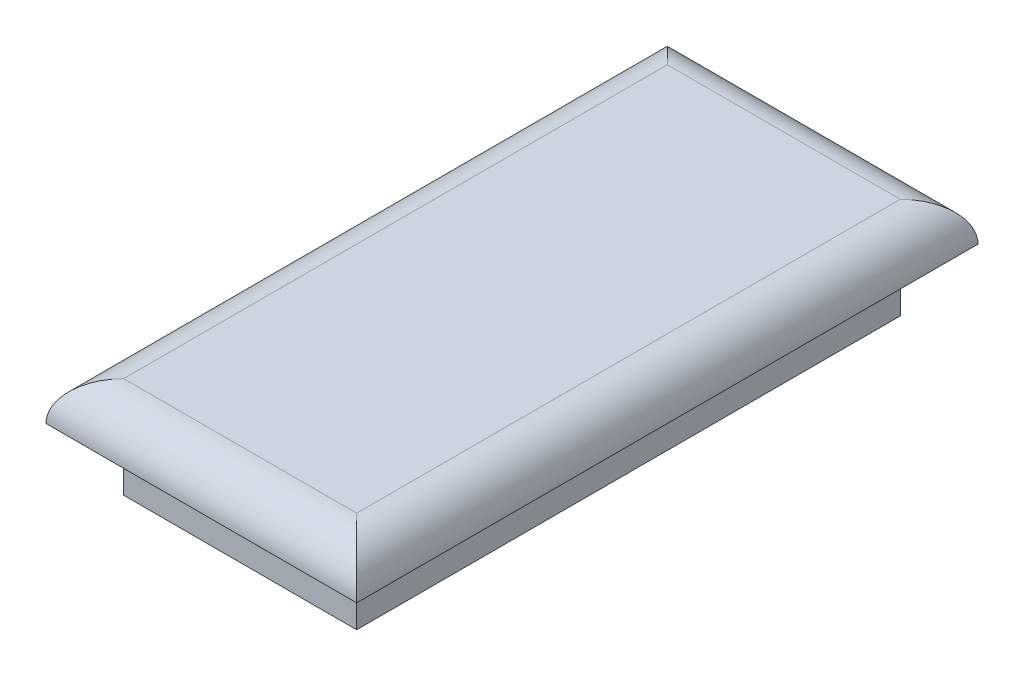
ISO-10303-21;
HEADER;
FILE_DESCRIPTION(('STEP AP214'),'2;1');
FILE_NAME('part.step','',(''),(''),'','','');
FILE_SCHEMA(('AUTOMOTIVE_DESIGN { 1 0 10303 214 1 1 1 1 }'));
ENDSEC;
DATA;
#1=APPLICATION_CONTEXT('core data for automotive mechanical design processes');
#2=APPLICATION_PROTOCOL_DEFINITION('international standard','automotive_design',2000,#1);
#3=PRODUCT_CONTEXT('',#1,'mechanical');
#4=PRODUCT('Part','Part','',(#3));
#5=PRODUCT_RELATED_PRODUCT_CATEGORY('part','',(#4));
#6=PRODUCT_DEFINITION_FORMATION('','',#4);
#7=PRODUCT_DEFINITION_CONTEXT('part definition',#1,'design');
#8=PRODUCT_DEFINITION('design','',#6,#7);
#9=PRODUCT_DEFINITION_SHAPE('','',#8);
#10=(LENGTH_UNIT() NAMED_UNIT(*) SI_UNIT(.MILLI.,.METRE.));
#11=(NAMED_UNIT(*) PLANE_ANGLE_UNIT() SI_UNIT($,.RADIAN.));
#12=(NAMED_UNIT(*) SI_UNIT($,.STERADIAN.) SOLID_ANGLE_UNIT());
#13=UNCERTAINTY_MEASURE_WITH_UNIT(LENGTH_MEASURE(1.E-05),#10,'distance_accuracy_value','');
#14=(GEOMETRIC_REPRESENTATION_CONTEXT(3) GLOBAL_UNCERTAINTY_ASSIGNED_CONTEXT((#13)) GLOBAL_UNIT_ASSIGNED_CONTEXT((#10,
#11,#12)) REPRESENTATION_CONTEXT('',''));
#15=CARTESIAN_POINT('',(0.,0.,0.));
#16=DIRECTION('',(0.,0.,1.));
#17=DIRECTION('',(1.,0.,0.));
#18=AXIS2_PLACEMENT_3D('',#15,#16,#17);
#19=CARTESIAN_POINT('',(9.525,5.08,22.225));
#20=DIRECTION('',(-1.,0.,0.));
#21=DIRECTION('',(0.,0.,1.));
#22=AXIS2_PLACEMENT_3D('',#19,#20,#21);
#23=PLANE('',#22);
#24=DIRECTION('',(0.,0.,-1.));
#25=VECTOR('',#24,1.);
#26=CARTESIAN_POINT('',(9.525,0.,22.225));
#27=LINE('',#26,#25);
#28=CARTESIAN_POINT('',(9.525,0.,22.225));
#29=VERTEX_POINT('',#28);
#30=CARTESIAN_POINT('',(9.525,0.,-22.225));
#31=VERTEX_POINT('',#30);
#32=EDGE_CURVE('E126',#29,#31,#27,.T.);
#33=ORIENTED_EDGE('',*,*,#32,.T.);
#34=DIRECTION('',(0.,-1.,0.));
#35=VECTOR('',#34,1.);
#36=CARTESIAN_POINT('',(9.525,5.08,-22.225));
#37=LINE('',#36,#35);
#38=CARTESIAN_POINT('',(9.525,5.08,-22.225));
#39=VERTEX_POINT('',#38);
#40=EDGE_CURVE('E156',#39,#31,#37,.T.);
#41=ORIENTED_EDGE('',*,*,#40,.F.);
#42=DIRECTION('',(0.,0.,-1.));
#43=VECTOR('',#42,1.);
#44=CARTESIAN_POINT('',(9.525,5.08,22.225));
#45=LINE('',#44,#43);
#46=CARTESIAN_POINT('',(9.525,5.08,22.225));
#47=VERTEX_POINT('',#46);
#48=EDGE_CURVE('E127',#47,#39,#45,.T.);
#49=ORIENTED_EDGE('',*,*,#48,.F.);
#50=DIRECTION('',(0.,-1.,0.));
#51=VECTOR('',#50,1.);
#52=CARTESIAN_POINT('',(9.525,5.08,22.225));
#53=LINE('',#52,#51);
#54=EDGE_CURVE('E140',#47,#29,#53,.T.);
#55=ORIENTED_EDGE('',*,*,#54,.T.);
#56=EDGE_LOOP('',(#33,#41,#49,#55));
#57=FACE_BOUND('',#56,.T.);
#58=ADVANCED_FACE('F37',(#57),#23,.F.);
#59=CARTESIAN_POINT('',(-9.525,5.08,-22.225));
#60=DIRECTION('',(0.,0.,1.));
#61=DIRECTION('',(1.,0.,0.));
#62=AXIS2_PLACEMENT_3D('',#59,#60,#61);
#63=PLANE('',#62);
#64=DIRECTION('',(-1.,0.,0.));
#65=VECTOR('',#64,1.);
#66=CARTESIAN_POINT('',(-9.525,0.,-22.225));
#67=LINE('',#66,#65);
#68=CARTESIAN_POINT('',(-9.525,0.,-22.225));
#69=VERTEX_POINT('',#68);
#70=EDGE_CURVE('E143',#31,#69,#67,.T.);
#71=ORIENTED_EDGE('',*,*,#70,.T.);
#72=DIRECTION('',(0.,-1.,0.));
#73=VECTOR('',#72,1.);
#74=CARTESIAN_POINT('',(-9.525,5.08,-22.225));
#75=LINE('',#74,#73);
#76=CARTESIAN_POINT('',(-9.525,5.08,-22.225));
#77=VERTEX_POINT('',#76);
#78=EDGE_CURVE('E153',#77,#69,#75,.T.);
#79=ORIENTED_EDGE('',*,*,#78,.F.);
#80=DIRECTION('',(-1.,0.,0.));
#81=VECTOR('',#80,1.);
#82=CARTESIAN_POINT('',(-9.525,5.08,-22.225));
#83=LINE('',#82,#81);
#84=EDGE_CURVE('E130',#39,#77,#83,.T.);
#85=ORIENTED_EDGE('',*,*,#84,.F.);
#86=ORIENTED_EDGE('',*,*,#40,.T.);
#87=EDGE_LOOP('',(#71,#79,#85,#86));
#88=FACE_BOUND('',#87,.T.);
#89=ADVANCED_FACE('F183',(#88),#63,.F.);
#90=CARTESIAN_POINT('',(-9.525,5.08,22.225));
#91=DIRECTION('',(1.,0.,0.));
#92=DIRECTION('',(0.,0.,-1.));
#93=AXIS2_PLACEMENT_3D('',#90,#91,#92);
#94=PLANE('',#93);
#95=DIRECTION('',(0.,0.,1.));
#96=VECTOR('',#95,1.);
#97=CARTESIAN_POINT('',(-9.525,0.,22.225));
#98=LINE('',#97,#96);
#99=CARTESIAN_POINT('',(-9.525,0.,22.225));
#100=VERTEX_POINT('',#99);
#101=EDGE_CURVE('E145',#69,#100,#98,.T.);
#102=ORIENTED_EDGE('',*,*,#101,.T.);
#103=DIRECTION('',(0.,-1.,0.));
#104=VECTOR('',#103,1.);
#105=CARTESIAN_POINT('',(-9.525,5.08,22.225));
#106=LINE('',#105,#104);
#107=CARTESIAN_POINT('',(-9.525,5.08,22.225));
#108=VERTEX_POINT('',#107);
#109=EDGE_CURVE('E150',#108,#100,#106,.T.);
#110=ORIENTED_EDGE('',*,*,#109,.F.);
#111=DIRECTION('',(0.,0.,1.));
#112=VECTOR('',#111,1.);
#113=CARTESIAN_POINT('',(-9.525,5.08,22.225));
#114=LINE('',#113,#112);
#115=EDGE_CURVE('E134',#77,#108,#114,.T.);
#116=ORIENTED_EDGE('',*,*,#115,.F.);
#117=ORIENTED_EDGE('',*,*,#78,.T.);
#118=EDGE_LOOP('',(#102,#110,#116,#117));
#119=FACE_BOUND('',#118,.T.);
#120=ADVANCED_FACE('F189',(#119),#94,.F.);
#121=CARTESIAN_POINT('',(-9.525,5.08,22.225));
#122=DIRECTION('',(0.,0.,-1.));
#123=DIRECTION('',(-1.,0.,0.));
#124=AXIS2_PLACEMENT_3D('',#121,#122,#123);
#125=PLANE('',#124);
#126=DIRECTION('',(1.,0.,0.));
#127=VECTOR('',#126,1.);
#128=CARTESIAN_POINT('',(-9.525,0.,22.225));
#129=LINE('',#128,#127);
#130=EDGE_CURVE('E131',#100,#29,#129,.T.);
#131=ORIENTED_EDGE('',*,*,#130,.T.);
#132=ORIENTED_EDGE('',*,*,#54,.F.);
#133=DIRECTION('',(1.,0.,0.));
#134=VECTOR('',#133,1.);
#135=CARTESIAN_POINT('',(-9.525,5.08,22.225));
#136=LINE('',#135,#134);
#137=EDGE_CURVE('E137',#108,#47,#136,.T.);
#138=ORIENTED_EDGE('',*,*,#137,.F.);
#139=ORIENTED_EDGE('',*,*,#109,.T.);
#140=EDGE_LOOP('',(#131,#132,#138,#139));
#141=FACE_BOUND('',#140,.T.);
#142=ADVANCED_FACE('F179',(#141),#125,.F.);
#143=CARTESIAN_POINT('',(0.,0.,0.));
#144=DIRECTION('',(0.,-1.,0.));
#145=DIRECTION('',(0.,0.,-1.));
#146=AXIS2_PLACEMENT_3D('',#143,#144,#145);
#147=PLANE('',#146);
#148=ORIENTED_EDGE('',*,*,#32,.F.);
#149=ORIENTED_EDGE('',*,*,#130,.F.);
#150=ORIENTED_EDGE('',*,*,#101,.F.);
#151=ORIENTED_EDGE('',*,*,#70,.F.);
#152=EDGE_LOOP('',(#148,#149,#150,#151));
#153=FACE_BOUND('',#152,.T.);
#154=ADVANCED_FACE('F171',(#153),#147,.T.);
#155=CARTESIAN_POINT('',(0.,8.255,0.));
#156=DIRECTION('',(0.,-1.,0.));
#157=DIRECTION('',(0.,0.,-1.));
#158=AXIS2_PLACEMENT_3D('',#155,#156,#157);
#159=PLANE('',#158);
#160=DIRECTION('',(0.,0.,-1.));
#161=VECTOR('',#160,1.);
#162=CARTESIAN_POINT('',(9.525,8.255,0.));
#163=LINE('',#162,#161);
#164=CARTESIAN_POINT('',(9.525,8.255,22.225));
#165=VERTEX_POINT('',#164);
#166=CARTESIAN_POINT('',(9.525,8.255,-22.225));
#167=VERTEX_POINT('',#166);
#168=EDGE_CURVE('E159',#165,#167,#163,.T.);
#169=ORIENTED_EDGE('',*,*,#168,.T.);
#170=DIRECTION('',(-1.,0.,0.));
#171=VECTOR('',#170,1.);
#172=CARTESIAN_POINT('',(0.,8.255,-22.225));
#173=LINE('',#172,#171);
#174=CARTESIAN_POINT('',(-9.525,8.255,-22.225));
#175=VERTEX_POINT('',#174);
#176=EDGE_CURVE('E11',#167,#175,#173,.T.);
#177=ORIENTED_EDGE('',*,*,#176,.T.);
#178=DIRECTION('',(0.,0.,1.));
#179=VECTOR('',#178,1.);
#180=CARTESIAN_POINT('',(-9.525,8.255,0.));
#181=LINE('',#180,#179);
#182=CARTESIAN_POINT('',(-9.525,8.255,22.225));
#183=VERTEX_POINT('',#182);
#184=EDGE_CURVE('E46',#175,#183,#181,.T.);
#185=ORIENTED_EDGE('',*,*,#184,.T.);
#186=DIRECTION('',(1.,0.,0.));
#187=VECTOR('',#186,1.);
#188=CARTESIAN_POINT('',(0.,8.255,22.225));
#189=LINE('',#188,#187);
#190=EDGE_CURVE('E161',#183,#165,#189,.T.);
#191=ORIENTED_EDGE('',*,*,#190,.T.);
#192=EDGE_LOOP('',(#169,#177,#185,#191));
#193=FACE_BOUND('',#192,.T.);
#194=ADVANCED_FACE('F169',(#193),#159,.F.);
#195=CARTESIAN_POINT('',(0.,5.08,0.));
#196=DIRECTION('',(0.,-1.,0.));
#197=DIRECTION('',(0.,0.,-1.));
#198=AXIS2_PLACEMENT_3D('',#195,#196,#197);
#199=PLANE('',#198);
#200=ORIENTED_EDGE('',*,*,#137,.T.);
#201=ORIENTED_EDGE('',*,*,#48,.T.);
#202=ORIENTED_EDGE('',*,*,#84,.T.);
#203=ORIENTED_EDGE('',*,*,#115,.T.);
#204=EDGE_LOOP('',(#200,#201,#202,#203));
#205=FACE_BOUND('',#204,.T.);
#206=DIRECTION('',(0.,0.,-1.));
#207=VECTOR('',#206,1.);
#208=CARTESIAN_POINT('',(12.7,5.08,25.4));
#209=LINE('',#208,#207);
#210=CARTESIAN_POINT('',(12.7,5.08,25.4));
#211=VERTEX_POINT('',#210);
#212=CARTESIAN_POINT('',(12.7,5.08,-25.4));
#213=VERTEX_POINT('',#212);
#214=EDGE_CURVE('E112',#211,#213,#209,.T.);
#215=ORIENTED_EDGE('',*,*,#214,.F.);
#216=DIRECTION('',(1.,0.,0.));
#217=VECTOR('',#216,1.);
#218=CARTESIAN_POINT('',(-12.7,5.08,25.4));
#219=LINE('',#218,#217);
#220=CARTESIAN_POINT('',(-12.7,5.08,25.4));
#221=VERTEX_POINT('',#220);
#222=EDGE_CURVE('E122',#221,#211,#219,.T.);
#223=ORIENTED_EDGE('',*,*,#222,.F.);
#224=DIRECTION('',(0.,0.,1.));
#225=VECTOR('',#224,1.);
#226=CARTESIAN_POINT('',(-12.7,5.08,25.4));
#227=LINE('',#226,#225);
#228=CARTESIAN_POINT('',(-12.7,5.08,-25.4));
#229=VERTEX_POINT('',#228);
#230=EDGE_CURVE('E120',#229,#221,#227,.T.);
#231=ORIENTED_EDGE('',*,*,#230,.F.);
#232=DIRECTION('',(-1.,0.,0.));
#233=VECTOR('',#232,1.);
#234=CARTESIAN_POINT('',(-12.7,5.08,-25.4));
#235=LINE('',#234,#233);
#236=EDGE_CURVE('E106',#213,#229,#235,.T.);
#237=ORIENTED_EDGE('',*,*,#236,.F.);
#238=EDGE_LOOP('',(#215,#223,#231,#237));
#239=FACE_BOUND('',#238,.T.);
#240=ADVANCED_FACE('F118',(#205,#239),#199,.T.);
#241=CARTESIAN_POINT('',(0.,5.08,22.225));
#242=DIRECTION('',(1.,0.,0.));
#243=DIRECTION('',(0.,0.,-1.));
#244=AXIS2_PLACEMENT_3D('',#241,#242,#243);
#245=CYLINDRICAL_SURFACE('',#244,3.175);
#246=CARTESIAN_POINT('',(-9.525,5.08,22.225));
#247=DIRECTION('',(0.707106781186547,0.,0.707106781186547));
#248=DIRECTION('',(0.707106781186547,0.,-0.707106781186547));
#249=AXIS2_PLACEMENT_3D('',#246,#247,#248);
#250=ELLIPSE('',#249,4.49012806053458,3.175);
#251=EDGE_CURVE('E109',#221,#183,#250,.F.);
#252=ORIENTED_EDGE('',*,*,#251,.F.);
#253=ORIENTED_EDGE('',*,*,#222,.T.);
#254=CARTESIAN_POINT('',(9.525,5.08,22.225));
#255=DIRECTION('',(0.707106781186547,0.,-0.707106781186547));
#256=DIRECTION('',(-0.707106781186547,0.,-0.707106781186547));
#257=AXIS2_PLACEMENT_3D('',#254,#255,#256);
#258=ELLIPSE('',#257,4.49012806053458,3.175);
#259=EDGE_CURVE('E41',#165,#211,#258,.T.);
#260=ORIENTED_EDGE('',*,*,#259,.F.);
#261=ORIENTED_EDGE('',*,*,#190,.F.);
#262=EDGE_LOOP('',(#252,#253,#260,#261));
#263=FACE_BOUND('',#262,.T.);
#264=ADVANCED_FACE('F39',(#263),#245,.T.);
#265=CARTESIAN_POINT('',(9.525,5.08,0.));
#266=DIRECTION('',(0.,0.,-1.));
#267=DIRECTION('',(-1.,0.,0.));
#268=AXIS2_PLACEMENT_3D('',#265,#266,#267);
#269=CYLINDRICAL_SURFACE('',#268,3.175);
#270=ORIENTED_EDGE('',*,*,#259,.T.);
#271=ORIENTED_EDGE('',*,*,#214,.T.);
#272=CARTESIAN_POINT('',(9.525,5.08,-22.225));
#273=DIRECTION('',(-0.707106781186547,0.,-0.707106781186547));
#274=DIRECTION('',(0.707106781186547,0.,-0.707106781186547));
#275=AXIS2_PLACEMENT_3D('',#272,#273,#274);
#276=ELLIPSE('',#275,4.49012806053458,3.175);
#277=EDGE_CURVE('E102',#167,#213,#276,.T.);
#278=ORIENTED_EDGE('',*,*,#277,.F.);
#279=ORIENTED_EDGE('',*,*,#168,.F.);
#280=EDGE_LOOP('',(#270,#271,#278,#279));
#281=FACE_BOUND('',#280,.T.);
#282=ADVANCED_FACE('F113',(#281),#269,.T.);
#283=CARTESIAN_POINT('',(-9.525,5.08,0.));
#284=DIRECTION('',(0.,0.,1.));
#285=DIRECTION('',(1.,0.,0.));
#286=AXIS2_PLACEMENT_3D('',#283,#284,#285);
#287=CYLINDRICAL_SURFACE('',#286,3.175);
#288=ORIENTED_EDGE('',*,*,#251,.T.);
#289=ORIENTED_EDGE('',*,*,#184,.F.);
#290=CARTESIAN_POINT('',(-9.525,5.08,-22.225));
#291=DIRECTION('',(-0.707106781186547,0.,0.707106781186547));
#292=DIRECTION('',(0.707106781186547,0.,0.707106781186547));
#293=AXIS2_PLACEMENT_3D('',#290,#291,#292);
#294=ELLIPSE('',#293,4.49012806053458,3.175);
#295=EDGE_CURVE('E54',#229,#175,#294,.F.);
#296=ORIENTED_EDGE('',*,*,#295,.F.);
#297=ORIENTED_EDGE('',*,*,#230,.T.);
#298=EDGE_LOOP('',(#288,#289,#296,#297));
#299=FACE_BOUND('',#298,.T.);
#300=ADVANCED_FACE('F167',(#299),#287,.T.);
#301=CARTESIAN_POINT('',(0.,5.08,-22.225));
#302=DIRECTION('',(-1.,0.,0.));
#303=DIRECTION('',(0.,0.,1.));
#304=AXIS2_PLACEMENT_3D('',#301,#302,#303);
#305=CYLINDRICAL_SURFACE('',#304,3.175);
#306=ORIENTED_EDGE('',*,*,#277,.T.);
#307=ORIENTED_EDGE('',*,*,#236,.T.);
#308=ORIENTED_EDGE('',*,*,#295,.T.);
#309=ORIENTED_EDGE('',*,*,#176,.F.);
#310=EDGE_LOOP('',(#306,#307,#308,#309));
#311=FACE_BOUND('',#310,.T.);
#312=ADVANCED_FACE('F104',(#311),#305,.T.);
#313=CLOSED_SHELL('',(#58,#89,#120,#142,#154,#194,#240,#264,#282,#300,#312));
#314=MANIFOLD_SOLID_BREP('B2',#313);
#315=ADVANCED_BREP_SHAPE_REPRESENTATION('',(#18,#314),#14);
#316=SHAPE_DEFINITION_REPRESENTATION(#9,#315);
ENDSEC;
END-ISO-10303-21;
